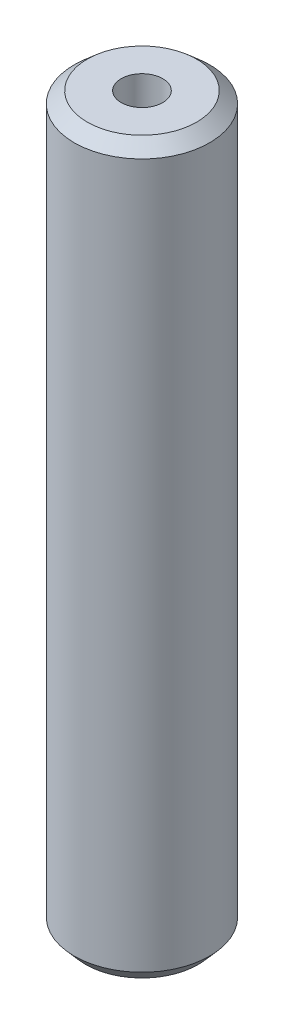
ISO-10303-21;
HEADER;
FILE_DESCRIPTION(('STEP AP214'),'2;1');
FILE_NAME('part.step','',(''),(''),'','','');
FILE_SCHEMA(('AUTOMOTIVE_DESIGN { 1 0 10303 214 1 1 1 1 }'));
ENDSEC;
DATA;
#1=APPLICATION_CONTEXT('core data for automotive mechanical design processes');
#2=APPLICATION_PROTOCOL_DEFINITION('international standard','automotive_design',2000,#1);
#3=PRODUCT_CONTEXT('',#1,'mechanical');
#4=PRODUCT('Part','Part','',(#3));
#5=PRODUCT_RELATED_PRODUCT_CATEGORY('part','',(#4));
#6=PRODUCT_DEFINITION_FORMATION('','',#4);
#7=PRODUCT_DEFINITION_CONTEXT('part definition',#1,'design');
#8=PRODUCT_DEFINITION('design','',#6,#7);
#9=PRODUCT_DEFINITION_SHAPE('','',#8);
#10=(LENGTH_UNIT() NAMED_UNIT(*) SI_UNIT(.MILLI.,.METRE.));
#11=(NAMED_UNIT(*) PLANE_ANGLE_UNIT() SI_UNIT($,.RADIAN.));
#12=(NAMED_UNIT(*) SI_UNIT($,.STERADIAN.) SOLID_ANGLE_UNIT());
#13=UNCERTAINTY_MEASURE_WITH_UNIT(LENGTH_MEASURE(1.E-05),#10,'distance_accuracy_value','');
#14=(GEOMETRIC_REPRESENTATION_CONTEXT(3) GLOBAL_UNCERTAINTY_ASSIGNED_CONTEXT((#13)) GLOBAL_UNIT_ASSIGNED_CONTEXT((#10,
#11,#12)) REPRESENTATION_CONTEXT('',''));
#15=CARTESIAN_POINT('',(0.,0.,0.));
#16=DIRECTION('',(0.,0.,1.));
#17=DIRECTION('',(1.,0.,0.));
#18=AXIS2_PLACEMENT_3D('',#15,#16,#17);
#19=CARTESIAN_POINT('',(0.,215.390074644557,0.));
#20=DIRECTION('',(0.,-1.,0.));
#21=DIRECTION('',(0.,0.,-1.));
#22=AXIS2_PLACEMENT_3D('',#19,#20,#21);
#23=CYLINDRICAL_SURFACE('',#22,20.);
#24=CARTESIAN_POINT('',(0.,212.033251045122,0.));
#25=DIRECTION('',(0.,1.,0.));
#26=DIRECTION('',(0.,0.,1.));
#27=AXIS2_PLACEMENT_3D('',#24,#25,#26);
#28=CIRCLE('',#27,20.);
#29=CARTESIAN_POINT('',(0.,212.033251045122,20.));
#30=VERTEX_POINT('',#29);
#31=EDGE_CURVE('E50',#30,#30,#28,.F.);
#32=ORIENTED_EDGE('',*,*,#31,.T.);
#33=EDGE_LOOP('',(#32));
#34=FACE_BOUND('',#33,.T.);
#35=CARTESIAN_POINT('',(0.,3.84286665400355,0.));
#36=DIRECTION('',(0.,1.,0.));
#37=DIRECTION('',(0.,0.,1.));
#38=AXIS2_PLACEMENT_3D('',#35,#36,#37);
#39=CIRCLE('',#38,20.);
#40=CARTESIAN_POINT('',(0.,3.84286665400355,20.));
#41=VERTEX_POINT('',#40);
#42=EDGE_CURVE('E51',#41,#41,#39,.T.);
#43=ORIENTED_EDGE('',*,*,#42,.T.);
#44=EDGE_LOOP('',(#43));
#45=FACE_BOUND('',#44,.T.);
#46=ADVANCED_FACE('F39',(#34,#45),#23,.T.);
#47=CARTESIAN_POINT('',(0.,215.390074644557,0.));
#48=DIRECTION('',(0.,1.,0.));
#49=DIRECTION('',(0.,0.,1.));
#50=AXIS2_PLACEMENT_3D('',#47,#48,#49);
#51=PLANE('',#50);
#52=CARTESIAN_POINT('',(0.,215.390074644557,0.));
#53=DIRECTION('',(0.,1.,0.));
#54=DIRECTION('',(0.,0.,1.));
#55=AXIS2_PLACEMENT_3D('',#52,#53,#54);
#56=CIRCLE('',#55,16.1571333459964);
#57=CARTESIAN_POINT('',(0.,215.390074644557,16.1571333459964));
#58=VERTEX_POINT('',#57);
#59=EDGE_CURVE('E54',#58,#58,#56,.T.);
#60=ORIENTED_EDGE('',*,*,#59,.T.);
#61=EDGE_LOOP('',(#60));
#62=FACE_BOUND('',#61,.T.);
#63=CARTESIAN_POINT('',(0.,215.390074644557,0.));
#64=DIRECTION('',(0.,1.,0.));
#65=DIRECTION('',(0.,0.,1.));
#66=AXIS2_PLACEMENT_3D('',#63,#64,#65);
#67=CIRCLE('',#66,6.14130455106985);
#68=CARTESIAN_POINT('',(0.,215.390074644557,6.14130455106985));
#69=VERTEX_POINT('',#68);
#70=EDGE_CURVE('E58',#69,#69,#67,.T.);
#71=ORIENTED_EDGE('',*,*,#70,.F.);
#72=EDGE_LOOP('',(#71));
#73=FACE_BOUND('',#72,.T.);
#74=ADVANCED_FACE('F69',(#62,#73),#51,.T.);
#75=CARTESIAN_POINT('',(0.,0.,0.));
#76=DIRECTION('',(0.,1.,0.));
#77=DIRECTION('',(0.,0.,1.));
#78=AXIS2_PLACEMENT_3D('',#75,#76,#77);
#79=PLANE('',#78);
#80=CARTESIAN_POINT('',(0.,0.,0.));
#81=DIRECTION('',(0.,1.,0.));
#82=DIRECTION('',(0.,0.,1.));
#83=AXIS2_PLACEMENT_3D('',#80,#81,#82);
#84=CIRCLE('',#83,16.6431764005656);
#85=CARTESIAN_POINT('',(0.,0.,16.6431764005656));
#86=VERTEX_POINT('',#85);
#87=EDGE_CURVE('E10',#86,#86,#84,.F.);
#88=ORIENTED_EDGE('',*,*,#87,.T.);
#89=EDGE_LOOP('',(#88));
#90=FACE_BOUND('',#89,.T.);
#91=CARTESIAN_POINT('',(0.,0.,0.));
#92=DIRECTION('',(0.,1.,0.));
#93=DIRECTION('',(0.,0.,1.));
#94=AXIS2_PLACEMENT_3D('',#91,#92,#93);
#95=CIRCLE('',#94,6.14130455106985);
#96=CARTESIAN_POINT('',(0.,0.,6.14130455106985));
#97=VERTEX_POINT('',#96);
#98=EDGE_CURVE('E63',#97,#97,#95,.T.);
#99=ORIENTED_EDGE('',*,*,#98,.T.);
#100=EDGE_LOOP('',(#99));
#101=FACE_BOUND('',#100,.T.);
#102=ADVANCED_FACE('F75',(#90,#101),#79,.F.);
#103=CARTESIAN_POINT('',(0.,215.390074644557,0.));
#104=DIRECTION('',(0.,-1.,0.));
#105=DIRECTION('',(0.,0.,-1.));
#106=AXIS2_PLACEMENT_3D('',#103,#104,#105);
#107=CYLINDRICAL_SURFACE('',#106,6.14130455106985);
#108=ORIENTED_EDGE('',*,*,#70,.T.);
#109=EDGE_LOOP('',(#108));
#110=FACE_BOUND('',#109,.T.);
#111=ORIENTED_EDGE('',*,*,#98,.F.);
#112=EDGE_LOOP('',(#111));
#113=FACE_BOUND('',#112,.T.);
#114=ADVANCED_FACE('F70',(#110,#113),#107,.F.);
#115=CARTESIAN_POINT('',(0.,215.390074644557,0.));
#116=DIRECTION('',(0.,-1.,0.));
#117=DIRECTION('',(0.,0.,-1.));
#118=AXIS2_PLACEMENT_3D('',#115,#116,#117);
#119=CONICAL_SURFACE('',#118,16.1571333459964,0.852804770873491);
#120=ORIENTED_EDGE('',*,*,#31,.F.);
#121=EDGE_LOOP('',(#120));
#122=FACE_BOUND('',#121,.T.);
#123=ORIENTED_EDGE('',*,*,#59,.F.);
#124=EDGE_LOOP('',(#123));
#125=FACE_BOUND('',#124,.T.);
#126=ADVANCED_FACE('F81',(#122,#125),#119,.T.);
#127=CARTESIAN_POINT('',(0.,3.84286665400355,0.));
#128=DIRECTION('',(0.,1.,0.));
#129=DIRECTION('',(0.,0.,1.));
#130=AXIS2_PLACEMENT_3D('',#127,#128,#129);
#131=CONICAL_SURFACE('',#130,20.,0.717991555921405);
#132=ORIENTED_EDGE('',*,*,#87,.F.);
#133=EDGE_LOOP('',(#132));
#134=FACE_BOUND('',#133,.T.);
#135=ORIENTED_EDGE('',*,*,#42,.F.);
#136=EDGE_LOOP('',(#135));
#137=FACE_BOUND('',#136,.T.);
#138=ADVANCED_FACE('F45',(#134,#137),#131,.T.);
#139=CLOSED_SHELL('',(#46,#74,#102,#114,#126,#138));
#140=MANIFOLD_SOLID_BREP('B2',#139);
#141=ADVANCED_BREP_SHAPE_REPRESENTATION('',(#18,#140),#14);
#142=SHAPE_DEFINITION_REPRESENTATION(#9,#141);
ENDSEC;
END-ISO-10303-21;
